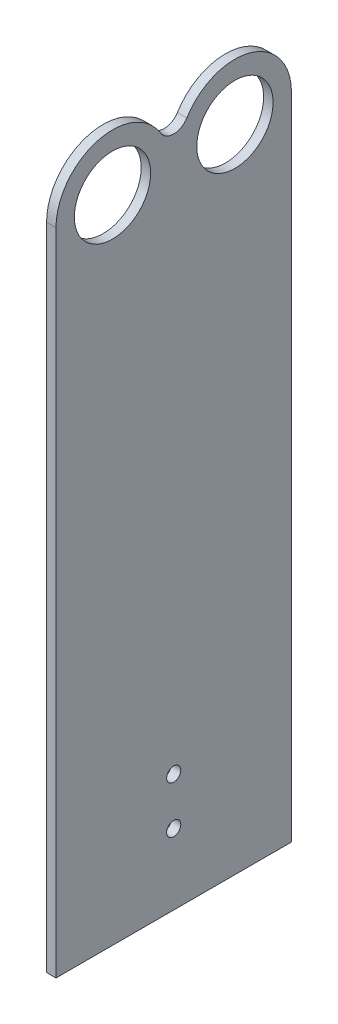
ISO-10303-21;
HEADER;
FILE_DESCRIPTION(('STEP AP214'),'2;1');
FILE_NAME('part.step','',(''),(''),'','','');
FILE_SCHEMA(('AUTOMOTIVE_DESIGN { 1 0 10303 214 1 1 1 1 }'));
ENDSEC;
DATA;
#1=APPLICATION_CONTEXT('core data for automotive mechanical design processes');
#2=APPLICATION_PROTOCOL_DEFINITION('international standard','automotive_design',2000,#1);
#3=PRODUCT_CONTEXT('',#1,'mechanical');
#4=PRODUCT('Part','Part','',(#3));
#5=PRODUCT_RELATED_PRODUCT_CATEGORY('part','',(#4));
#6=PRODUCT_DEFINITION_FORMATION('','',#4);
#7=PRODUCT_DEFINITION_CONTEXT('part definition',#1,'design');
#8=PRODUCT_DEFINITION('design','',#6,#7);
#9=PRODUCT_DEFINITION_SHAPE('','',#8);
#10=(LENGTH_UNIT() NAMED_UNIT(*) SI_UNIT(.MILLI.,.METRE.));
#11=(NAMED_UNIT(*) PLANE_ANGLE_UNIT() SI_UNIT($,.RADIAN.));
#12=(NAMED_UNIT(*) SI_UNIT($,.STERADIAN.) SOLID_ANGLE_UNIT());
#13=UNCERTAINTY_MEASURE_WITH_UNIT(LENGTH_MEASURE(1.E-05),#10,'distance_accuracy_value','');
#14=(GEOMETRIC_REPRESENTATION_CONTEXT(3) GLOBAL_UNCERTAINTY_ASSIGNED_CONTEXT((#13)) GLOBAL_UNIT_ASSIGNED_CONTEXT((#10,
#11,#12)) REPRESENTATION_CONTEXT('',''));
#15=CARTESIAN_POINT('',(0.,0.,0.));
#16=DIRECTION('',(0.,0.,1.));
#17=DIRECTION('',(1.,0.,0.));
#18=AXIS2_PLACEMENT_3D('',#15,#16,#17);
#19=CARTESIAN_POINT('',(0.,35.,50.));
#20=DIRECTION('',(1.,0.,0.));
#21=DIRECTION('',(0.,1.,0.));
#22=AXIS2_PLACEMENT_3D('',#19,#20,#21);
#23=PLANE('',#22);
#24=CARTESIAN_POINT('',(0.,-100.,25.));
#25=DIRECTION('',(1.,0.,0.));
#26=DIRECTION('',(0.,1.,0.));
#27=AXIS2_PLACEMENT_3D('',#24,#25,#26);
#28=CIRCLE('',#27,1.5);
#29=CARTESIAN_POINT('',(0.,-98.5,25.));
#30=VERTEX_POINT('',#29);
#31=EDGE_CURVE('E189',#30,#30,#28,.T.);
#32=ORIENTED_EDGE('',*,*,#31,.T.);
#33=EDGE_LOOP('',(#32));
#34=FACE_BOUND('',#33,.T.);
#35=CARTESIAN_POINT('',(0.,-90.,25.));
#36=DIRECTION('',(1.,0.,0.));
#37=DIRECTION('',(0.,1.,0.));
#38=AXIS2_PLACEMENT_3D('',#35,#36,#37);
#39=CIRCLE('',#38,1.5);
#40=CARTESIAN_POINT('',(0.,-88.5,25.));
#41=VERTEX_POINT('',#40);
#42=EDGE_CURVE('E193',#41,#41,#39,.T.);
#43=ORIENTED_EDGE('',*,*,#42,.T.);
#44=EDGE_LOOP('',(#43));
#45=FACE_BOUND('',#44,.T.);
#46=CARTESIAN_POINT('',(0.,23.,38.));
#47=DIRECTION('',(1.,0.,0.));
#48=DIRECTION('',(0.,1.,0.));
#49=AXIS2_PLACEMENT_3D('',#46,#47,#48);
#50=CIRCLE('',#49,8.1);
#51=CARTESIAN_POINT('',(0.,31.1,38.));
#52=VERTEX_POINT('',#51);
#53=EDGE_CURVE('E219',#52,#52,#50,.T.);
#54=ORIENTED_EDGE('',*,*,#53,.T.);
#55=EDGE_LOOP('',(#54));
#56=FACE_BOUND('',#55,.T.);
#57=CARTESIAN_POINT('',(0.,23.,12.));
#58=DIRECTION('',(1.,0.,0.));
#59=DIRECTION('',(0.,1.,0.));
#60=AXIS2_PLACEMENT_3D('',#57,#58,#59);
#61=CIRCLE('',#60,8.1);
#62=CARTESIAN_POINT('',(0.,31.1,12.));
#63=VERTEX_POINT('',#62);
#64=EDGE_CURVE('E215',#63,#63,#61,.T.);
#65=ORIENTED_EDGE('',*,*,#64,.T.);
#66=EDGE_LOOP('',(#65));
#67=FACE_BOUND('',#66,.T.);
#68=CARTESIAN_POINT('',(0.,23.,38.));
#69=DIRECTION('',(1.,0.,0.));
#70=DIRECTION('',(0.,1.,0.));
#71=AXIS2_PLACEMENT_3D('',#68,#69,#70);
#72=CIRCLE('',#71,12.);
#73=CARTESIAN_POINT('',(0.,29.289169107972,27.7801001995455));
#74=VERTEX_POINT('',#73);
#75=CARTESIAN_POINT('',(0.,23.,50.));
#76=VERTEX_POINT('',#75);
#77=EDGE_CURVE('E128',#74,#76,#72,.T.);
#78=ORIENTED_EDGE('',*,*,#77,.F.);
#79=CARTESIAN_POINT('',(0.,31.,25.));
#80=DIRECTION('',(1.,0.,0.));
#81=DIRECTION('',(0.,1.,0.));
#82=AXIS2_PLACEMENT_3D('',#79,#80,#81);
#83=CIRCLE('',#82,3.26433752247375);
#84=CARTESIAN_POINT('',(0.,29.289169107972,22.2198998004545));
#85=VERTEX_POINT('',#84);
#86=EDGE_CURVE('E182',#74,#85,#83,.T.);
#87=ORIENTED_EDGE('',*,*,#86,.T.);
#88=CARTESIAN_POINT('',(0.,23.,12.));
#89=DIRECTION('',(1.,0.,0.));
#90=DIRECTION('',(0.,1.,0.));
#91=AXIS2_PLACEMENT_3D('',#88,#89,#90);
#92=CIRCLE('',#91,12.);
#93=CARTESIAN_POINT('',(0.,23.,0.));
#94=VERTEX_POINT('',#93);
#95=EDGE_CURVE('E206',#94,#85,#92,.T.);
#96=ORIENTED_EDGE('',*,*,#95,.F.);
#97=DIRECTION('',(0.,-1.,0.));
#98=VECTOR('',#97,1.);
#99=CARTESIAN_POINT('',(0.,35.,0.));
#100=LINE('',#99,#98);
#101=CARTESIAN_POINT('',(0.,-115.,0.));
#102=VERTEX_POINT('',#101);
#103=EDGE_CURVE('E223',#94,#102,#100,.T.);
#104=ORIENTED_EDGE('',*,*,#103,.T.);
#105=DIRECTION('',(0.,0.,-1.));
#106=VECTOR('',#105,1.);
#107=CARTESIAN_POINT('',(0.,-115.,50.));
#108=LINE('',#107,#106);
#109=CARTESIAN_POINT('',(0.,-115.,50.));
#110=VERTEX_POINT('',#109);
#111=EDGE_CURVE('E245',#110,#102,#108,.T.);
#112=ORIENTED_EDGE('',*,*,#111,.F.);
#113=DIRECTION('',(0.,-1.,0.));
#114=VECTOR('',#113,1.);
#115=CARTESIAN_POINT('',(0.,35.,50.));
#116=LINE('',#115,#114);
#117=EDGE_CURVE('E224',#76,#110,#116,.T.);
#118=ORIENTED_EDGE('',*,*,#117,.F.);
#119=EDGE_LOOP('',(#78,#87,#96,#104,#112,#118));
#120=FACE_BOUND('',#119,.T.);
#121=ADVANCED_FACE('F114',(#34,#45,#56,#67,#120),#23,.F.);
#122=CARTESIAN_POINT('',(1.99999999999999,-115.,50.));
#123=DIRECTION('',(-1.,0.,0.));
#124=DIRECTION('',(0.,0.,1.));
#125=AXIS2_PLACEMENT_3D('',#122,#123,#124);
#126=PLANE('',#125);
#127=CARTESIAN_POINT('',(2.00000000000001,-100.,25.));
#128=DIRECTION('',(-1.,0.,0.));
#129=DIRECTION('',(0.,-1.,0.));
#130=AXIS2_PLACEMENT_3D('',#127,#128,#129);
#131=CIRCLE('',#130,1.5);
#132=CARTESIAN_POINT('',(2.00000000000001,-101.5,25.));
#133=VERTEX_POINT('',#132);
#134=EDGE_CURVE('E372',#133,#133,#131,.T.);
#135=ORIENTED_EDGE('',*,*,#134,.T.);
#136=EDGE_LOOP('',(#135));
#137=FACE_BOUND('',#136,.T.);
#138=CARTESIAN_POINT('',(2.00000000000001,-90.,25.));
#139=DIRECTION('',(-1.,0.,0.));
#140=DIRECTION('',(0.,-1.,0.));
#141=AXIS2_PLACEMENT_3D('',#138,#139,#140);
#142=CIRCLE('',#141,1.5);
#143=CARTESIAN_POINT('',(2.00000000000001,-91.5,25.));
#144=VERTEX_POINT('',#143);
#145=EDGE_CURVE('E374',#144,#144,#142,.T.);
#146=ORIENTED_EDGE('',*,*,#145,.T.);
#147=EDGE_LOOP('',(#146));
#148=FACE_BOUND('',#147,.T.);
#149=CARTESIAN_POINT('',(1.99999999999999,23.,38.));
#150=DIRECTION('',(1.,0.,0.));
#151=DIRECTION('',(0.,1.,0.));
#152=AXIS2_PLACEMENT_3D('',#149,#150,#151);
#153=CIRCLE('',#152,8.1);
#154=CARTESIAN_POINT('',(1.99999999999999,31.1,38.));
#155=VERTEX_POINT('',#154);
#156=EDGE_CURVE('E173',#155,#155,#153,.T.);
#157=ORIENTED_EDGE('',*,*,#156,.F.);
#158=EDGE_LOOP('',(#157));
#159=FACE_BOUND('',#158,.T.);
#160=CARTESIAN_POINT('',(1.99999999999999,23.,12.));
#161=DIRECTION('',(1.,0.,0.));
#162=DIRECTION('',(0.,1.,0.));
#163=AXIS2_PLACEMENT_3D('',#160,#161,#162);
#164=CIRCLE('',#163,8.1);
#165=CARTESIAN_POINT('',(1.99999999999999,31.1,12.));
#166=VERTEX_POINT('',#165);
#167=EDGE_CURVE('E203',#166,#166,#164,.T.);
#168=ORIENTED_EDGE('',*,*,#167,.F.);
#169=EDGE_LOOP('',(#168));
#170=FACE_BOUND('',#169,.T.);
#171=CARTESIAN_POINT('',(1.99999999999999,31.,25.));
#172=DIRECTION('',(1.,0.,0.));
#173=DIRECTION('',(0.,1.,0.));
#174=AXIS2_PLACEMENT_3D('',#171,#172,#173);
#175=CIRCLE('',#174,3.26433752247375);
#176=CARTESIAN_POINT('',(1.99999999999999,29.289169107972,27.7801001995455));
#177=VERTEX_POINT('',#176);
#178=CARTESIAN_POINT('',(1.99999999999999,29.289169107972,22.2198998004545));
#179=VERTEX_POINT('',#178);
#180=EDGE_CURVE('E180',#177,#179,#175,.T.);
#181=ORIENTED_EDGE('',*,*,#180,.F.);
#182=CARTESIAN_POINT('',(1.99999999999999,23.,38.));
#183=DIRECTION('',(1.,0.,0.));
#184=DIRECTION('',(0.,1.,0.));
#185=AXIS2_PLACEMENT_3D('',#182,#183,#184);
#186=CIRCLE('',#185,12.);
#187=CARTESIAN_POINT('',(1.99999999999999,23.,50.));
#188=VERTEX_POINT('',#187);
#189=EDGE_CURVE('E164',#177,#188,#186,.T.);
#190=ORIENTED_EDGE('',*,*,#189,.T.);
#191=DIRECTION('',(0.,1.,0.));
#192=VECTOR('',#191,1.);
#193=CARTESIAN_POINT('',(1.99999999999999,-115.,50.));
#194=LINE('',#193,#192);
#195=CARTESIAN_POINT('',(1.99999999999999,-115.,50.));
#196=VERTEX_POINT('',#195);
#197=EDGE_CURVE('E231',#196,#188,#194,.T.);
#198=ORIENTED_EDGE('',*,*,#197,.F.);
#199=DIRECTION('',(0.,0.,-1.));
#200=VECTOR('',#199,1.);
#201=CARTESIAN_POINT('',(1.99999999999999,-115.,50.));
#202=LINE('',#201,#200);
#203=CARTESIAN_POINT('',(1.99999999999999,-115.,0.));
#204=VERTEX_POINT('',#203);
#205=EDGE_CURVE('E234',#196,#204,#202,.T.);
#206=ORIENTED_EDGE('',*,*,#205,.T.);
#207=DIRECTION('',(0.,1.,0.));
#208=VECTOR('',#207,1.);
#209=CARTESIAN_POINT('',(1.99999999999999,-115.,0.));
#210=LINE('',#209,#208);
#211=CARTESIAN_POINT('',(1.99999999999999,23.,0.));
#212=VERTEX_POINT('',#211);
#213=EDGE_CURVE('E228',#204,#212,#210,.T.);
#214=ORIENTED_EDGE('',*,*,#213,.T.);
#215=CARTESIAN_POINT('',(1.99999999999999,23.,12.));
#216=DIRECTION('',(1.,0.,0.));
#217=DIRECTION('',(0.,1.,0.));
#218=AXIS2_PLACEMENT_3D('',#215,#216,#217);
#219=CIRCLE('',#218,12.);
#220=EDGE_CURVE('E136',#212,#179,#219,.T.);
#221=ORIENTED_EDGE('',*,*,#220,.T.);
#222=EDGE_LOOP('',(#181,#190,#198,#206,#214,#221));
#223=FACE_BOUND('',#222,.T.);
#224=ADVANCED_FACE('F186',(#137,#148,#159,#170,#223),#126,.F.);
#225=CARTESIAN_POINT('',(0.,-115.,50.));
#226=DIRECTION('',(0.,1.,0.));
#227=DIRECTION('',(0.,0.,1.));
#228=AXIS2_PLACEMENT_3D('',#225,#226,#227);
#229=PLANE('',#228);
#230=DIRECTION('',(1.,0.,0.));
#231=VECTOR('',#230,1.);
#232=CARTESIAN_POINT('',(0.,-115.,0.));
#233=LINE('',#232,#231);
#234=EDGE_CURVE('E237',#102,#204,#233,.T.);
#235=ORIENTED_EDGE('',*,*,#234,.T.);
#236=ORIENTED_EDGE('',*,*,#205,.F.);
#237=DIRECTION('',(1.,0.,0.));
#238=VECTOR('',#237,1.);
#239=CARTESIAN_POINT('',(0.,-115.,50.));
#240=LINE('',#239,#238);
#241=EDGE_CURVE('E227',#110,#196,#240,.T.);
#242=ORIENTED_EDGE('',*,*,#241,.F.);
#243=ORIENTED_EDGE('',*,*,#111,.T.);
#244=EDGE_LOOP('',(#235,#236,#242,#243));
#245=FACE_BOUND('',#244,.T.);
#246=ADVANCED_FACE('F258',(#245),#229,.F.);
#247=CARTESIAN_POINT('',(0.,0.,50.));
#248=DIRECTION('',(0.,0.,1.));
#249=DIRECTION('',(1.,0.,0.));
#250=AXIS2_PLACEMENT_3D('',#247,#248,#249);
#251=PLANE('',#250);
#252=DIRECTION('',(1.,0.,0.));
#253=VECTOR('',#252,1.);
#254=CARTESIAN_POINT('',(-48.,23.,50.));
#255=LINE('',#254,#253);
#256=EDGE_CURVE('E12',#76,#188,#255,.T.);
#257=ORIENTED_EDGE('',*,*,#256,.F.);
#258=ORIENTED_EDGE('',*,*,#117,.T.);
#259=ORIENTED_EDGE('',*,*,#241,.T.);
#260=ORIENTED_EDGE('',*,*,#197,.T.);
#261=EDGE_LOOP('',(#257,#258,#259,#260));
#262=FACE_BOUND('',#261,.T.);
#263=ADVANCED_FACE('F271',(#262),#251,.T.);
#264=CARTESIAN_POINT('',(0.,0.,0.));
#265=DIRECTION('',(0.,0.,1.));
#266=DIRECTION('',(1.,0.,0.));
#267=AXIS2_PLACEMENT_3D('',#264,#265,#266);
#268=PLANE('',#267);
#269=ORIENTED_EDGE('',*,*,#103,.F.);
#270=DIRECTION('',(1.,0.,0.));
#271=VECTOR('',#270,1.);
#272=CARTESIAN_POINT('',(-48.,23.,0.));
#273=LINE('',#272,#271);
#274=EDGE_CURVE('E122',#94,#212,#273,.T.);
#275=ORIENTED_EDGE('',*,*,#274,.T.);
#276=ORIENTED_EDGE('',*,*,#213,.F.);
#277=ORIENTED_EDGE('',*,*,#234,.F.);
#278=EDGE_LOOP('',(#269,#275,#276,#277));
#279=FACE_BOUND('',#278,.T.);
#280=ADVANCED_FACE('F252',(#279),#268,.F.);
#281=CARTESIAN_POINT('',(-48.,23.,12.));
#282=DIRECTION('',(1.,0.,0.));
#283=DIRECTION('',(0.,1.,0.));
#284=AXIS2_PLACEMENT_3D('',#281,#282,#283);
#285=CYLINDRICAL_SURFACE('',#284,12.);
#286=ORIENTED_EDGE('',*,*,#95,.T.);
#287=DIRECTION('',(1.,0.,0.));
#288=VECTOR('',#287,1.);
#289=CARTESIAN_POINT('',(-48.,29.289169107972,22.2198998004545));
#290=LINE('',#289,#288);
#291=EDGE_CURVE('E184',#85,#179,#290,.T.);
#292=ORIENTED_EDGE('',*,*,#291,.T.);
#293=ORIENTED_EDGE('',*,*,#220,.F.);
#294=ORIENTED_EDGE('',*,*,#274,.F.);
#295=EDGE_LOOP('',(#286,#292,#293,#294));
#296=FACE_BOUND('',#295,.T.);
#297=ADVANCED_FACE('F262',(#296),#285,.T.);
#298=CARTESIAN_POINT('',(-48.,23.,38.));
#299=DIRECTION('',(1.,0.,0.));
#300=DIRECTION('',(0.,1.,0.));
#301=AXIS2_PLACEMENT_3D('',#298,#299,#300);
#302=CYLINDRICAL_SURFACE('',#301,12.);
#303=ORIENTED_EDGE('',*,*,#77,.T.);
#304=ORIENTED_EDGE('',*,*,#256,.T.);
#305=ORIENTED_EDGE('',*,*,#189,.F.);
#306=DIRECTION('',(1.,0.,0.));
#307=VECTOR('',#306,1.);
#308=CARTESIAN_POINT('',(-48.,29.289169107972,27.7801001995455));
#309=LINE('',#308,#307);
#310=EDGE_CURVE('E167',#74,#177,#309,.T.);
#311=ORIENTED_EDGE('',*,*,#310,.F.);
#312=EDGE_LOOP('',(#303,#304,#305,#311));
#313=FACE_BOUND('',#312,.T.);
#314=ADVANCED_FACE('F166',(#313),#302,.T.);
#315=CARTESIAN_POINT('',(-48.,23.,12.));
#316=DIRECTION('',(1.,0.,0.));
#317=DIRECTION('',(0.,1.,0.));
#318=AXIS2_PLACEMENT_3D('',#315,#316,#317);
#319=CYLINDRICAL_SURFACE('',#318,8.1);
#320=ORIENTED_EDGE('',*,*,#167,.T.);
#321=EDGE_LOOP('',(#320));
#322=FACE_BOUND('',#321,.T.);
#323=ORIENTED_EDGE('',*,*,#64,.F.);
#324=EDGE_LOOP('',(#323));
#325=FACE_BOUND('',#324,.T.);
#326=ADVANCED_FACE('F269',(#322,#325),#319,.F.);
#327=CARTESIAN_POINT('',(-48.,23.,38.));
#328=DIRECTION('',(1.,0.,0.));
#329=DIRECTION('',(0.,1.,0.));
#330=AXIS2_PLACEMENT_3D('',#327,#328,#329);
#331=CYLINDRICAL_SURFACE('',#330,8.1);
#332=ORIENTED_EDGE('',*,*,#156,.T.);
#333=EDGE_LOOP('',(#332));
#334=FACE_BOUND('',#333,.T.);
#335=ORIENTED_EDGE('',*,*,#53,.F.);
#336=EDGE_LOOP('',(#335));
#337=FACE_BOUND('',#336,.T.);
#338=ADVANCED_FACE('F293',(#334,#337),#331,.F.);
#339=CARTESIAN_POINT('',(-48.,31.,25.));
#340=DIRECTION('',(1.,0.,0.));
#341=DIRECTION('',(0.,1.,0.));
#342=AXIS2_PLACEMENT_3D('',#339,#340,#341);
#343=CYLINDRICAL_SURFACE('',#342,3.26433752247375);
#344=ORIENTED_EDGE('',*,*,#310,.T.);
#345=ORIENTED_EDGE('',*,*,#180,.T.);
#346=ORIENTED_EDGE('',*,*,#291,.F.);
#347=ORIENTED_EDGE('',*,*,#86,.F.);
#348=EDGE_LOOP('',(#344,#345,#346,#347));
#349=FACE_BOUND('',#348,.T.);
#350=ADVANCED_FACE('F178',(#349),#343,.F.);
#351=CARTESIAN_POINT('',(2.00000000000001,-90.,25.));
#352=DIRECTION('',(-1.,0.,0.));
#353=DIRECTION('',(0.,-1.,0.));
#354=AXIS2_PLACEMENT_3D('',#351,#352,#353);
#355=CYLINDRICAL_SURFACE('',#354,1.5);
#356=ORIENTED_EDGE('',*,*,#145,.F.);
#357=EDGE_LOOP('',(#356));
#358=FACE_BOUND('',#357,.T.);
#359=ORIENTED_EDGE('',*,*,#42,.F.);
#360=EDGE_LOOP('',(#359));
#361=FACE_BOUND('',#360,.T.);
#362=ADVANCED_FACE('F346',(#358,#361),#355,.F.);
#363=CARTESIAN_POINT('',(2.00000000000001,-100.,25.));
#364=DIRECTION('',(-1.,0.,0.));
#365=DIRECTION('',(0.,-1.,0.));
#366=AXIS2_PLACEMENT_3D('',#363,#364,#365);
#367=CYLINDRICAL_SURFACE('',#366,1.5);
#368=ORIENTED_EDGE('',*,*,#134,.F.);
#369=EDGE_LOOP('',(#368));
#370=FACE_BOUND('',#369,.T.);
#371=ORIENTED_EDGE('',*,*,#31,.F.);
#372=EDGE_LOOP('',(#371));
#373=FACE_BOUND('',#372,.T.);
#374=ADVANCED_FACE('F355',(#370,#373),#367,.F.);
#375=CLOSED_SHELL('',(#121,#224,#246,#263,#280,#297,#314,#326,#338,#350,#362,#374));
#376=MANIFOLD_SOLID_BREP('B2',#375);
#377=ADVANCED_BREP_SHAPE_REPRESENTATION('',(#18,#376),#14);
#378=SHAPE_DEFINITION_REPRESENTATION(#9,#377);
ENDSEC;
END-ISO-10303-21;
